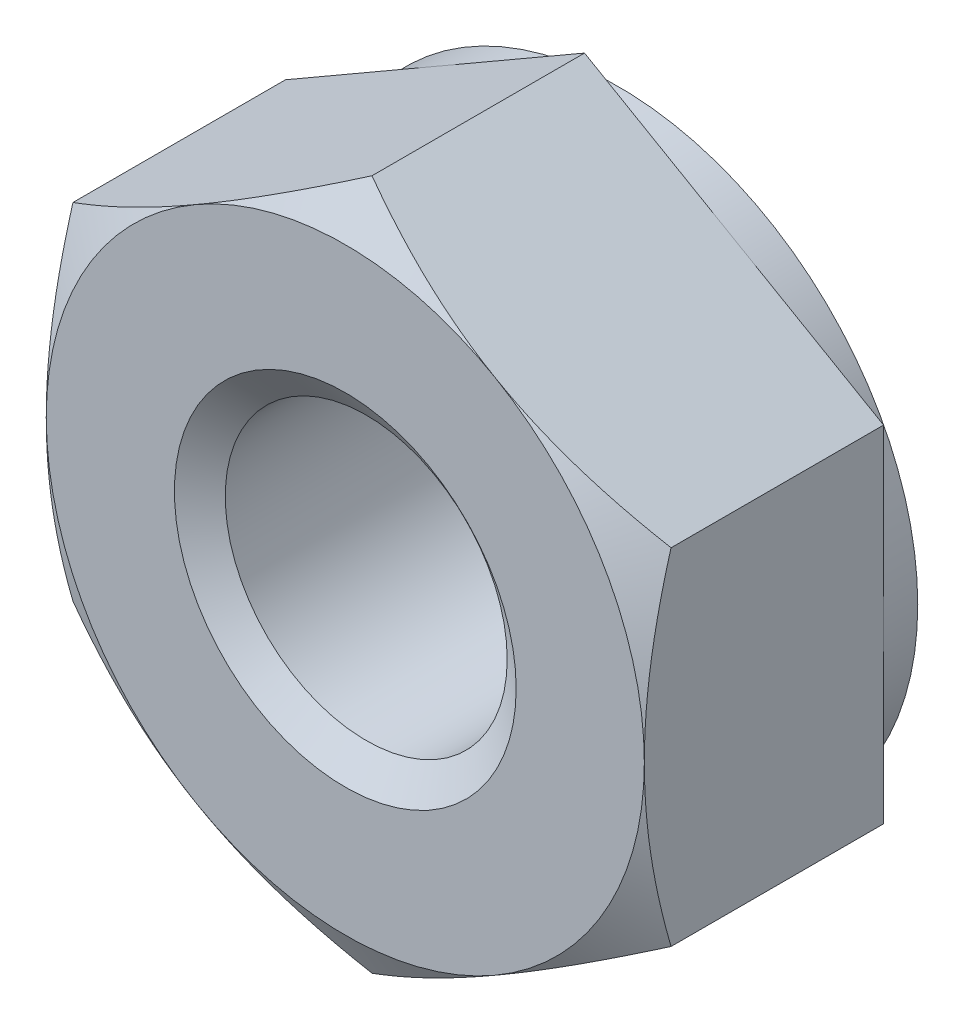
ISO-10303-21;
HEADER;
FILE_DESCRIPTION(('STEP AP214'),'2;1');
FILE_NAME('part.step','',(''),(''),'','','');
FILE_SCHEMA(('AUTOMOTIVE_DESIGN { 1 0 10303 214 1 1 1 1 }'));
ENDSEC;
DATA;
#1=APPLICATION_CONTEXT('core data for automotive mechanical design processes');
#2=APPLICATION_PROTOCOL_DEFINITION('international standard','automotive_design',2000,#1);
#3=PRODUCT_CONTEXT('',#1,'mechanical');
#4=PRODUCT('Part','Part','',(#3));
#5=PRODUCT_RELATED_PRODUCT_CATEGORY('part','',(#4));
#6=PRODUCT_DEFINITION_FORMATION('','',#4);
#7=PRODUCT_DEFINITION_CONTEXT('part definition',#1,'design');
#8=PRODUCT_DEFINITION('design','',#6,#7);
#9=PRODUCT_DEFINITION_SHAPE('','',#8);
#10=(LENGTH_UNIT() NAMED_UNIT(*) SI_UNIT(.MILLI.,.METRE.));
#11=(NAMED_UNIT(*) PLANE_ANGLE_UNIT() SI_UNIT($,.RADIAN.));
#12=(NAMED_UNIT(*) SI_UNIT($,.STERADIAN.) SOLID_ANGLE_UNIT());
#13=UNCERTAINTY_MEASURE_WITH_UNIT(LENGTH_MEASURE(1.E-05),#10,'distance_accuracy_value','');
#14=(GEOMETRIC_REPRESENTATION_CONTEXT(3) GLOBAL_UNCERTAINTY_ASSIGNED_CONTEXT((#13)) GLOBAL_UNIT_ASSIGNED_CONTEXT((#10,
#11,#12)) REPRESENTATION_CONTEXT('',''));
#15=CARTESIAN_POINT('',(0.,0.,0.));
#16=DIRECTION('',(0.,0.,1.));
#17=DIRECTION('',(1.,0.,0.));
#18=AXIS2_PLACEMENT_3D('',#15,#16,#17);
#19=CARTESIAN_POINT('',(0.,0.,-3.2));
#20=DIRECTION('',(0.,0.,1.));
#21=DIRECTION('',(1.,0.,0.));
#22=AXIS2_PLACEMENT_3D('',#19,#20,#21);
#23=CYLINDRICAL_SURFACE('',#22,1.65);
#24=CARTESIAN_POINT('',(0.,0.,-0.245072638373387));
#25=DIRECTION('',(0.,0.,1.));
#26=DIRECTION('',(1.,0.,0.));
#27=AXIS2_PLACEMENT_3D('',#24,#25,#26);
#28=CIRCLE('',#27,1.65);
#29=CARTESIAN_POINT('',(1.65,0.,-0.245072638373387));
#30=VERTEX_POINT('',#29);
#31=EDGE_CURVE('E143',#30,#30,#28,.F.);
#32=ORIENTED_EDGE('',*,*,#31,.F.);
#33=EDGE_LOOP('',(#32));
#34=FACE_BOUND('',#33,.T.);
#35=CARTESIAN_POINT('',(0.,0.,-2.9295273616266));
#36=DIRECTION('',(0.,0.,-1.));
#37=DIRECTION('',(-1.,0.,0.));
#38=AXIS2_PLACEMENT_3D('',#35,#36,#37);
#39=CIRCLE('',#38,1.65);
#40=CARTESIAN_POINT('',(-1.65,0.,-2.9295273616266));
#41=VERTEX_POINT('',#40);
#42=EDGE_CURVE('E31',#41,#41,#39,.F.);
#43=ORIENTED_EDGE('',*,*,#42,.F.);
#44=EDGE_LOOP('',(#43));
#45=FACE_BOUND('',#44,.T.);
#46=ADVANCED_FACE('F26',(#34,#45),#23,.F.);
#47=CARTESIAN_POINT('',(0.,4.04145188432739,-3.2));
#48=DIRECTION('',(0.,0.,-1.));
#49=DIRECTION('',(-1.,0.,0.));
#50=AXIS2_PLACEMENT_3D('',#47,#48,#49);
#51=PLANE('',#50);
#52=CARTESIAN_POINT('',(0.,0.,-3.2));
#53=DIRECTION('',(0.,0.,-1.));
#54=DIRECTION('',(-1.,0.,0.));
#55=AXIS2_PLACEMENT_3D('',#52,#53,#54);
#56=CIRCLE('',#55,3.5);
#57=CARTESIAN_POINT('',(-3.5,0.,-3.2));
#58=VERTEX_POINT('',#57);
#59=EDGE_CURVE('E270',#58,#58,#56,.F.);
#60=ORIENTED_EDGE('',*,*,#59,.F.);
#61=EDGE_LOOP('',(#60));
#62=FACE_BOUND('',#61,.T.);
#63=CARTESIAN_POINT('',(0.,0.,-3.2));
#64=DIRECTION('',(0.,0.,-1.));
#65=DIRECTION('',(-1.,0.,0.));
#66=AXIS2_PLACEMENT_3D('',#63,#64,#65);
#67=CIRCLE('',#66,2.);
#68=CARTESIAN_POINT('',(-2.,0.,-3.2));
#69=VERTEX_POINT('',#68);
#70=EDGE_CURVE('E290',#69,#69,#67,.F.);
#71=ORIENTED_EDGE('',*,*,#70,.T.);
#72=EDGE_LOOP('',(#71));
#73=FACE_BOUND('',#72,.T.);
#74=ADVANCED_FACE('F222',(#62,#73),#51,.T.);
#75=CARTESIAN_POINT('',(0.,4.04145188432739,0.));
#76=DIRECTION('',(0.,0.,-1.));
#77=DIRECTION('',(-1.,0.,0.));
#78=AXIS2_PLACEMENT_3D('',#75,#76,#77);
#79=PLANE('',#78);
#80=CARTESIAN_POINT('',(0.,0.,0.));
#81=DIRECTION('',(0.,0.,-1.));
#82=DIRECTION('',(-1.,0.,0.));
#83=AXIS2_PLACEMENT_3D('',#80,#81,#82);
#84=CIRCLE('',#83,3.5);
#85=CARTESIAN_POINT('',(-1.75000000000001,3.03108891324553,0.));
#86=VERTEX_POINT('',#85);
#87=CARTESIAN_POINT('',(-3.5,0.,0.));
#88=VERTEX_POINT('',#87);
#89=EDGE_CURVE('E38',#86,#88,#84,.F.);
#90=ORIENTED_EDGE('',*,*,#89,.T.);
#91=CARTESIAN_POINT('',(-1.75000000000002,-3.03108891324552,0.));
#92=VERTEX_POINT('',#91);
#93=EDGE_CURVE('E11',#88,#92,#84,.F.);
#94=ORIENTED_EDGE('',*,*,#93,.T.);
#95=CARTESIAN_POINT('',(1.75000000000001,-3.03108891324553,0.));
#96=VERTEX_POINT('',#95);
#97=EDGE_CURVE('E36',#92,#96,#84,.F.);
#98=ORIENTED_EDGE('',*,*,#97,.T.);
#99=CARTESIAN_POINT('',(3.5,0.,0.));
#100=VERTEX_POINT('',#99);
#101=EDGE_CURVE('E122',#96,#100,#84,.F.);
#102=ORIENTED_EDGE('',*,*,#101,.T.);
#103=CARTESIAN_POINT('',(0.,0.,0.));
#104=DIRECTION('',(0.,0.,1.));
#105=DIRECTION('',(1.,0.,0.));
#106=AXIS2_PLACEMENT_3D('',#103,#104,#105);
#107=CIRCLE('',#106,3.5);
#108=CARTESIAN_POINT('',(1.75000000000002,3.03108891324552,0.));
#109=VERTEX_POINT('',#108);
#110=EDGE_CURVE('E134',#100,#109,#107,.T.);
#111=ORIENTED_EDGE('',*,*,#110,.T.);
#112=EDGE_CURVE('E149',#109,#86,#84,.F.);
#113=ORIENTED_EDGE('',*,*,#112,.T.);
#114=EDGE_LOOP('',(#90,#94,#98,#102,#111,#113));
#115=FACE_BOUND('',#114,.T.);
#116=CARTESIAN_POINT('',(0.,0.,0.));
#117=DIRECTION('',(0.,0.,1.));
#118=DIRECTION('',(1.,0.,0.));
#119=AXIS2_PLACEMENT_3D('',#116,#117,#118);
#120=CIRCLE('',#119,2.);
#121=CARTESIAN_POINT('',(2.,0.,0.));
#122=VERTEX_POINT('',#121);
#123=EDGE_CURVE('E289',#122,#122,#120,.T.);
#124=ORIENTED_EDGE('',*,*,#123,.F.);
#125=EDGE_LOOP('',(#124));
#126=FACE_BOUND('',#125,.T.);
#127=ADVANCED_FACE('F146',(#115,#126),#79,.F.);
#128=CARTESIAN_POINT('',(0.,4.04145188432739,-3.2));
#129=DIRECTION('',(-0.500000000000003,0.866025403784437,0.));
#130=DIRECTION('',(-0.866025403784437,-0.500000000000003,0.));
#131=AXIS2_PLACEMENT_3D('',#128,#129,#130);
#132=PLANE('',#131);
#133=DIRECTION('',(0.,0.,1.));
#134=VECTOR('',#133,1.);
#135=CARTESIAN_POINT('',(-3.5,2.02072594216368,-3.2));
#136=LINE('',#135,#134);
#137=CARTESIAN_POINT('',(-3.5,2.02072594216368,-2.8));
#138=VERTEX_POINT('',#137);
#139=CARTESIAN_POINT('',(-3.5,2.02072594216368,-0.312607391169653));
#140=VERTEX_POINT('',#139);
#141=EDGE_CURVE('E279',#138,#140,#136,.T.);
#142=ORIENTED_EDGE('',*,*,#141,.T.);
#143=CARTESIAN_POINT('',(-3.5002,2.02061047210984,-0.31267406069337));
#144=CARTESIAN_POINT('',(-3.34639282154755,2.10941108799266,-0.261385788989982));
#145=CARTESIAN_POINT('',(-3.19125798916558,2.19897822522908,-0.214740953816196));
#146=CARTESIAN_POINT('',(-2.87830199342322,2.37966345361544,-0.133321875533347));
#147=CARTESIAN_POINT('',(-2.72047526921251,2.47078475532382,-0.0985764355845601));
#148=CARTESIAN_POINT('',(-2.40677778961987,2.65189807961073,-0.0444900271828349));
#149=CARTESIAN_POINT('',(-2.25095530083931,2.74186223545399,-0.0247890862603805));
#150=CARTESIAN_POINT('',(-1.93857711279463,2.92221386641055,-0.00127013273725367));
#151=CARTESIAN_POINT('',(-1.78202254896577,3.01260068598001,0.00256735545443516));
#152=CARTESIAN_POINT('',(-1.48949078007901,3.1814939814933,-0.00541530187697786));
#153=CARTESIAN_POINT('',(-1.3534697875421,3.26002573814993,-0.0152754340696077));
#154=CARTESIAN_POINT('',(-1.082313979711,3.41657761679354,-0.0465264668994053));
#155=CARTESIAN_POINT('',(-0.947180102315316,3.49459719728458,-0.0679280432858007));
#156=CARTESIAN_POINT('',(-0.675465207594812,3.65147186489429,-0.121430407880581));
#157=CARTESIAN_POINT('',(-0.538918580721659,3.73030709667644,-0.153757994445092));
#158=CARTESIAN_POINT('',(-0.267861907055492,3.88680174018325,-0.227128933808001));
#159=CARTESIAN_POINT('',(-0.133348387531456,3.9644631568901,-0.268155046569875));
#160=CARTESIAN_POINT('',(0.000200000000009097,4.04156735438123,-0.31267406069338));
#161=B_SPLINE_CURVE_WITH_KNOTS('',3,(#143,#144,#145,#146,#147,#148,#149,#150,#151,#152,#153,
#154,#155,#156,#157,#158,#159,#160),.UNSPECIFIED.,.F.,.F.,(4,2,2,2,2,2,2,2,4),(0.,
0.554793832886254,1.11092123814984,1.65328467083219,2.19498204478403,2.6666513085086,
3.13875761298268,3.62133612600511,4.10296698719189),.UNSPECIFIED.);
#162=EDGE_CURVE('E50',#140,#86,#161,.T.);
#163=ORIENTED_EDGE('',*,*,#162,.T.);
#164=CARTESIAN_POINT('',(0.,4.04145188432739,-0.312607391169653));
#165=VERTEX_POINT('',#164);
#166=EDGE_CURVE('E158',#86,#165,#161,.T.);
#167=ORIENTED_EDGE('',*,*,#166,.T.);
#168=DIRECTION('',(0.,0.,1.));
#169=VECTOR('',#168,1.);
#170=CARTESIAN_POINT('',(0.,4.04145188432739,-3.2));
#171=LINE('',#170,#169);
#172=CARTESIAN_POINT('',(0.,4.04145188432739,-2.8));
#173=VERTEX_POINT('',#172);
#174=EDGE_CURVE('E267',#173,#165,#171,.T.);
#175=ORIENTED_EDGE('',*,*,#174,.F.);
#176=DIRECTION('',(-0.866025403784437,-0.500000000000003,0.));
#177=VECTOR('',#176,1.);
#178=CARTESIAN_POINT('',(0.,4.04145188432739,-2.8));
#179=LINE('',#178,#177);
#180=CARTESIAN_POINT('',(-1.75000000000001,3.03108891324553,-2.8));
#181=VERTEX_POINT('',#180);
#182=EDGE_CURVE('E255',#173,#181,#179,.T.);
#183=ORIENTED_EDGE('',*,*,#182,.T.);
#184=EDGE_CURVE('E251',#181,#138,#179,.T.);
#185=ORIENTED_EDGE('',*,*,#184,.T.);
#186=EDGE_LOOP('',(#142,#163,#167,#175,#183,#185));
#187=FACE_BOUND('',#186,.T.);
#188=ADVANCED_FACE('F28',(#187),#132,.T.);
#189=CARTESIAN_POINT('',(3.5,2.02072594216367,-3.2));
#190=DIRECTION('',(0.500000000000007,0.866025403784435,0.));
#191=DIRECTION('',(-0.866025403784435,0.500000000000007,0.));
#192=AXIS2_PLACEMENT_3D('',#189,#190,#191);
#193=PLANE('',#192);
#194=ORIENTED_EDGE('',*,*,#174,.T.);
#195=CARTESIAN_POINT('',(-0.000199999999990839,4.04156735438123,-0.312674060693381));
#196=CARTESIAN_POINT('',(0.153607178452458,3.95276673849841,-0.261385788989992));
#197=CARTESIAN_POINT('',(0.308742010834433,3.86319960126199,-0.214740953816205));
#198=CARTESIAN_POINT('',(0.62169800657679,3.68251437287563,-0.133321875533355));
#199=CARTESIAN_POINT('',(0.779524730787505,3.59139307116726,-0.0985764355845665));
#200=CARTESIAN_POINT('',(1.09322221038014,3.41027974688034,-0.0444900271828393));
#201=CARTESIAN_POINT('',(1.2490446991607,3.32031559103708,-0.0247890862603838));
#202=CARTESIAN_POINT('',(1.56142288720538,3.13996396008051,-0.00127013273725512));
#203=CARTESIAN_POINT('',(1.71797745103424,3.04957714051106,0.0025673554544345));
#204=CARTESIAN_POINT('',(2.010509219921,2.88068384499777,-0.00541530187697712));
#205=CARTESIAN_POINT('',(2.14653021245791,2.80215208834114,-0.0152754340696062));
#206=CARTESIAN_POINT('',(2.417686020289,2.64560020969752,-0.046526466899402));
#207=CARTESIAN_POINT('',(2.55281989768469,2.56758062920648,-0.0679280432857965));
#208=CARTESIAN_POINT('',(2.82453479240519,2.41070596159677,-0.121430407880575));
#209=CARTESIAN_POINT('',(2.96108141927834,2.33187072981462,-0.153757994445085));
#210=CARTESIAN_POINT('',(3.23213809294451,2.17537608630781,-0.227128933807992));
#211=CARTESIAN_POINT('',(3.36665161246854,2.09771466960097,-0.268155046569864));
#212=CARTESIAN_POINT('',(3.5002,2.02061047210983,-0.312674060693368));
#213=B_SPLINE_CURVE_WITH_KNOTS('',3,(#195,#196,#197,#198,#199,#200,#201,#202,#203,#204,#205,
#206,#207,#208,#209,#210,#211,#212),.UNSPECIFIED.,.F.,.F.,(4,2,2,2,2,2,2,2,4),(0.,
0.554793832886256,1.11092123814984,1.65328467083219,2.19498204478404,2.66665130850861,
3.13875761298268,3.62133612600511,4.10296698719188),.UNSPECIFIED.);
#214=EDGE_CURVE('E155',#165,#109,#213,.T.);
#215=ORIENTED_EDGE('',*,*,#214,.T.);
#216=CARTESIAN_POINT('',(3.5,2.02072594216371,-0.312607391169653));
#217=VERTEX_POINT('',#216);
#218=EDGE_CURVE('E137',#109,#217,#213,.T.);
#219=ORIENTED_EDGE('',*,*,#218,.T.);
#220=DIRECTION('',(0.,0.,1.));
#221=VECTOR('',#220,1.);
#222=CARTESIAN_POINT('',(3.5,2.02072594216367,-3.2));
#223=LINE('',#222,#221);
#224=CARTESIAN_POINT('',(3.5,2.02072594216367,-2.8));
#225=VERTEX_POINT('',#224);
#226=EDGE_CURVE('E154',#225,#217,#223,.T.);
#227=ORIENTED_EDGE('',*,*,#226,.F.);
#228=DIRECTION('',(-0.866025403784435,0.500000000000007,0.));
#229=VECTOR('',#228,1.);
#230=CARTESIAN_POINT('',(3.5,2.02072594216367,-2.8));
#231=LINE('',#230,#229);
#232=CARTESIAN_POINT('',(1.75000000000002,3.03108891324552,-2.8));
#233=VERTEX_POINT('',#232);
#234=EDGE_CURVE('E263',#225,#233,#231,.T.);
#235=ORIENTED_EDGE('',*,*,#234,.T.);
#236=EDGE_CURVE('E259',#233,#173,#231,.T.);
#237=ORIENTED_EDGE('',*,*,#236,.T.);
#238=EDGE_LOOP('',(#194,#215,#219,#227,#235,#237));
#239=FACE_BOUND('',#238,.T.);
#240=ADVANCED_FACE('F235',(#239),#193,.T.);
#241=CARTESIAN_POINT('',(3.5,2.02072594216367,-3.2));
#242=DIRECTION('',(-1.,0.,0.));
#243=DIRECTION('',(0.,0.,1.));
#244=AXIS2_PLACEMENT_3D('',#241,#242,#243);
#245=PLANE('',#244);
#246=CARTESIAN_POINT('',(3.5,-5.35926299121409,-1.67484346858558));
#247=CARTESIAN_POINT('',(3.5,-5.20559319908845,-1.60058173692106));
#248=CARTESIAN_POINT('',(3.5,-5.05156008083379,-1.5270582283315));
#249=CARTESIAN_POINT('',(3.5,-4.74257074180714,-1.38190950344754));
#250=CARTESIAN_POINT('',(3.5,-4.5876143668244,-1.31028461582135));
#251=CARTESIAN_POINT('',(3.5,-4.27574500225546,-1.16897765517626));
#252=CARTESIAN_POINT('',(3.5,-4.11882589028195,-1.09930904568018));
#253=CARTESIAN_POINT('',(3.5,-3.80369792903858,-0.962964262242778));
#254=CARTESIAN_POINT('',(3.5,-3.64548914750598,-0.896287932319535));
#255=CARTESIAN_POINT('',(3.5,-3.32556618401858,-0.765931819095082));
#256=CARTESIAN_POINT('',(3.5,-3.16383281219927,-0.70229887368888));
#257=CARTESIAN_POINT('',(3.5,-2.838458409456,-0.580016702089507));
#258=CARTESIAN_POINT('',(3.5,-2.67481716858829,-0.521368030370705));
#259=CARTESIAN_POINT('',(3.5,-2.34570278472052,-0.410630279877034));
#260=CARTESIAN_POINT('',(3.5,-2.18023438248745,-0.358527255435869));
#261=CARTESIAN_POINT('',(3.5,-1.84694522806372,-0.262572936976453));
#262=CARTESIAN_POINT('',(3.5,-1.67912523787533,-0.218719033467167));
#263=CARTESIAN_POINT('',(3.5,-1.34101828610928,-0.141391945584794));
#264=CARTESIAN_POINT('',(3.5,-1.17073068027696,-0.10792152521198));
#265=CARTESIAN_POINT('',(3.5,-0.828102385138509,-0.0536149564320558));
#266=CARTESIAN_POINT('',(3.5,-0.655761694017326,-0.0327788191952412));
#267=CARTESIAN_POINT('',(3.5,-0.311020490924473,-0.00558408650575998));
#268=CARTESIAN_POINT('',(3.5,-0.138627397207282,0.000866163165908653));
#269=CARTESIAN_POINT('',(3.5,0.206038074906514,-0.0010535580779475));
#270=CARTESIAN_POINT('',(3.5,0.37831047302316,-0.00941968196343273));
#271=CARTESIAN_POINT('',(3.5,0.672490555822307,-0.035768892786892));
#272=CARTESIAN_POINT('',(3.5,0.794722791084071,-0.0503206340384207));
#273=CARTESIAN_POINT('',(3.5,1.03824305430558,-0.0859367340533542));
#274=CARTESIAN_POINT('',(3.5,1.15953093025884,-0.107002119926139));
#275=CARTESIAN_POINT('',(3.5,1.52187914771346,-0.178863187081449));
#276=CARTESIAN_POINT('',(3.5,1.76124104212629,-0.238305275622005));
#277=CARTESIAN_POINT('',(3.5,2.11940971387705,-0.340826814402548));
#278=CARTESIAN_POINT('',(3.5,2.24008344316343,-0.377749699085176));
#279=CARTESIAN_POINT('',(3.5,2.48017139213725,-0.455249007699286));
#280=CARTESIAN_POINT('',(3.5,2.5995864179561,-0.495822911663541));
#281=CARTESIAN_POINT('',(3.5,2.83665760451795,-0.579779986782743));
#282=CARTESIAN_POINT('',(3.5,2.9543198820348,-0.623146060034304));
#283=CARTESIAN_POINT('',(3.5,3.18873153508796,-0.712423559566855));
#284=CARTESIAN_POINT('',(3.5,3.3054805195946,-0.758336014592938));
#285=CARTESIAN_POINT('',(3.5,3.42180736613345,-0.805270380724058));
#286=B_SPLINE_CURVE_WITH_KNOTS('',3,(#246,#247,#248,#249,#250,#251,#252,#253,#254,#255,#256,
#257,#258,#259,#260,#261,#262,#263,#264,#265,#266,#267,#268,#269,#270,#271,#272,#273,#274,#275,
#276,#277,#278,#279,#280,#281,#282,#283,#284,#285),.UNSPECIFIED.,.F.,.F.,(4,2,2,2,2,2,2,2,2,2,2,
2,2,2,2,2,2,2,2,4),(0.,0.512025318465739,1.02413870177436,1.53918270315242,2.05419982499224,
2.57553975872799,3.09693761309354,3.61720506610402,4.13730766217539,4.65754858684366,
5.17778997146963,5.69470725122284,6.21149033452403,6.58059623222333,6.94976036239486,
7.68863804939852,8.06719621660479,8.44549507476761,8.82166461280099,9.1979872473341),.UNSPECIFIED.);
#287=CARTESIAN_POINT('',(3.49999999999999,-2.02072594216373,-0.312607391169653));
#288=VERTEX_POINT('',#287);
#289=EDGE_CURVE('E118',#288,#100,#286,.T.);
#290=ORIENTED_EDGE('',*,*,#289,.F.);
#291=DIRECTION('',(0.,0.,1.));
#292=VECTOR('',#291,1.);
#293=CARTESIAN_POINT('',(3.5,-2.02072594216372,-3.2));
#294=LINE('',#293,#292);
#295=CARTESIAN_POINT('',(3.5,-2.02072594216372,-2.8));
#296=VERTEX_POINT('',#295);
#297=EDGE_CURVE('E272',#296,#288,#294,.T.);
#298=ORIENTED_EDGE('',*,*,#297,.F.);
#299=DIRECTION('',(0.,-1.,0.));
#300=VECTOR('',#299,1.);
#301=CARTESIAN_POINT('',(3.5,2.02072594216367,-2.8));
#302=LINE('',#301,#300);
#303=CARTESIAN_POINT('',(3.5,0.,-2.8));
#304=VERTEX_POINT('',#303);
#305=EDGE_CURVE('E264',#304,#296,#302,.T.);
#306=ORIENTED_EDGE('',*,*,#305,.F.);
#307=EDGE_CURVE('E266',#225,#304,#302,.T.);
#308=ORIENTED_EDGE('',*,*,#307,.F.);
#309=ORIENTED_EDGE('',*,*,#226,.T.);
#310=EDGE_CURVE('E131',#100,#217,#286,.T.);
#311=ORIENTED_EDGE('',*,*,#310,.F.);
#312=EDGE_LOOP('',(#290,#298,#306,#308,#309,#311));
#313=FACE_BOUND('',#312,.T.);
#314=ADVANCED_FACE('F151',(#313),#245,.F.);
#315=CARTESIAN_POINT('',(0.,-4.04145188432744,-3.2));
#316=DIRECTION('',(0.500000000000004,-0.866025403784436,0.));
#317=DIRECTION('',(0.866025403784436,0.500000000000004,0.));
#318=AXIS2_PLACEMENT_3D('',#315,#316,#317);
#319=PLANE('',#318);
#320=ORIENTED_EDGE('',*,*,#297,.T.);
#321=CARTESIAN_POINT('',(3.5002,-2.02061047210988,-0.312674060693384));
#322=CARTESIAN_POINT('',(3.34639282154755,-2.1094110879927,-0.261385788989997));
#323=CARTESIAN_POINT('',(3.19125798916558,-2.19897822522913,-0.214740953816211));
#324=CARTESIAN_POINT('',(2.87830199342322,-2.37966345361549,-0.133321875533363));
#325=CARTESIAN_POINT('',(2.7204752692125,-2.47078475532386,-0.0985764355845769));
#326=CARTESIAN_POINT('',(2.40677778961987,-2.65189807961078,-0.0444900271828534));
#327=CARTESIAN_POINT('',(2.25095530083931,-2.74186223545403,-0.0247890862603999));
#328=CARTESIAN_POINT('',(1.93857711279462,-2.9222138664106,-0.00127013273727479));
#329=CARTESIAN_POINT('',(1.78202254896577,-3.01260068598006,0.00256735545441324));
#330=CARTESIAN_POINT('',(1.48949078007901,-3.18149398149335,-0.00541530187700181));
#331=CARTESIAN_POINT('',(1.35346978754209,-3.26002573814998,-0.0152754340696326));
#332=CARTESIAN_POINT('',(1.082313979711,-3.41657761679359,-0.0465264668994311));
#333=CARTESIAN_POINT('',(0.947180102315313,-3.49459719728463,-0.0679280432858265));
#334=CARTESIAN_POINT('',(0.675465207594813,-3.65147186489434,-0.121430407880607));
#335=CARTESIAN_POINT('',(0.538918580721662,-3.73030709667649,-0.153757994445118));
#336=CARTESIAN_POINT('',(0.267861907055497,-3.8868017401833,-0.227128933808027));
#337=CARTESIAN_POINT('',(0.133348387531462,-3.96446315689014,-0.2681550465699));
#338=CARTESIAN_POINT('',(-0.000200000000001484,-4.04156735438127,-0.312674060693404));
#339=B_SPLINE_CURVE_WITH_KNOTS('',3,(#321,#322,#323,#324,#325,#326,#327,#328,#329,#330,#331,
#332,#333,#334,#335,#336,#337,#338),.UNSPECIFIED.,.F.,.F.,(4,2,2,2,2,2,2,2,4),(0.,
0.554793832886257,1.11092123814984,1.6532846708322,2.19498204478404,2.66665130850861,
3.13875761298269,3.62133612600511,4.10296698719189),.UNSPECIFIED.);
#340=EDGE_CURVE('E125',#288,#96,#339,.T.);
#341=ORIENTED_EDGE('',*,*,#340,.T.);
#342=CARTESIAN_POINT('',(0.,-4.04145188432739,-0.312607391169653));
#343=VERTEX_POINT('',#342);
#344=EDGE_CURVE('E165',#96,#343,#339,.T.);
#345=ORIENTED_EDGE('',*,*,#344,.T.);
#346=DIRECTION('',(0.,0.,1.));
#347=VECTOR('',#346,1.);
#348=CARTESIAN_POINT('',(0.,-4.04145188432744,-3.2));
#349=LINE('',#348,#347);
#350=CARTESIAN_POINT('',(0.,-4.04145188432744,-2.8));
#351=VERTEX_POINT('',#350);
#352=EDGE_CURVE('E274',#351,#343,#349,.T.);
#353=ORIENTED_EDGE('',*,*,#352,.F.);
#354=DIRECTION('',(0.866025403784436,0.500000000000004,0.));
#355=VECTOR('',#354,1.);
#356=CARTESIAN_POINT('',(0.,-4.04145188432744,-2.8));
#357=LINE('',#356,#355);
#358=CARTESIAN_POINT('',(1.75000000000003,-3.03108891324556,-2.8));
#359=VERTEX_POINT('',#358);
#360=EDGE_CURVE('E256',#351,#359,#357,.T.);
#361=ORIENTED_EDGE('',*,*,#360,.T.);
#362=EDGE_CURVE('E260',#359,#296,#357,.T.);
#363=ORIENTED_EDGE('',*,*,#362,.T.);
#364=EDGE_LOOP('',(#320,#341,#345,#353,#361,#363));
#365=FACE_BOUND('',#364,.T.);
#366=ADVANCED_FACE('F208',(#365),#319,.T.);
#367=CARTESIAN_POINT('',(-3.5,-2.02072594216371,-3.2));
#368=DIRECTION('',(-0.500000000000006,-0.866025403784435,0.));
#369=DIRECTION('',(0.866025403784435,-0.500000000000006,0.));
#370=AXIS2_PLACEMENT_3D('',#367,#368,#369);
#371=PLANE('',#370);
#372=ORIENTED_EDGE('',*,*,#352,.T.);
#373=CARTESIAN_POINT('',(0.00019999999999873,-4.04156735438127,-0.312674060693404));
#374=CARTESIAN_POINT('',(-0.153607178452452,-3.95276673849845,-0.261385788990015));
#375=CARTESIAN_POINT('',(-0.308742010834428,-3.86319960126203,-0.214740953816227));
#376=CARTESIAN_POINT('',(-0.621698006576788,-3.68251437287567,-0.133321875533376));
#377=CARTESIAN_POINT('',(-0.779524730787504,-3.59139307116729,-0.0985764355845872));
#378=CARTESIAN_POINT('',(-1.09322221038014,-3.41027974688037,-0.0444900271828594));
#379=CARTESIAN_POINT('',(-1.24904469916071,-3.32031559103712,-0.0247890862604038));
#380=CARTESIAN_POINT('',(-1.56142288720539,-3.13996396008055,-0.00127013273727466));
#381=CARTESIAN_POINT('',(-1.71797745103425,-3.04957714051109,0.00256735545441532));
#382=CARTESIAN_POINT('',(-2.01050921992101,-2.8806838449978,-0.00541530187699605));
#383=CARTESIAN_POINT('',(-2.14653021245792,-2.80215208834117,-0.0152754340696249));
#384=CARTESIAN_POINT('',(-2.41768602028901,-2.64560020969756,-0.0465264668994196));
#385=CARTESIAN_POINT('',(-2.55281989768469,-2.56758062920652,-0.0679280432858133));
#386=CARTESIAN_POINT('',(-2.82453479240519,-2.41070596159681,-0.12143040788059));
#387=CARTESIAN_POINT('',(-2.96108141927834,-2.33187072981466,-0.153757994445099));
#388=CARTESIAN_POINT('',(-3.2321380929445,-2.17537608630785,-0.227128933808004));
#389=CARTESIAN_POINT('',(-3.36665161246854,-2.09771466960101,-0.268155046569876));
#390=CARTESIAN_POINT('',(-3.5002,-2.02061047210987,-0.312674060693379));
#391=B_SPLINE_CURVE_WITH_KNOTS('',3,(#373,#374,#375,#376,#377,#378,#379,#380,#381,#382,#383,
#384,#385,#386,#387,#388,#389,#390),.UNSPECIFIED.,.F.,.F.,(4,2,2,2,2,2,2,2,4),(0.,
0.554793832886262,1.11092123814985,1.65328467083221,2.19498204478406,2.66665130850863,
3.13875761298269,3.62133612600511,4.10296698719189),.UNSPECIFIED.);
#392=EDGE_CURVE('E202',#343,#92,#391,.T.);
#393=ORIENTED_EDGE('',*,*,#392,.T.);
#394=CARTESIAN_POINT('',(-3.5,-2.02072594216372,-0.312607391169653));
#395=VERTEX_POINT('',#394);
#396=EDGE_CURVE('E195',#92,#395,#391,.T.);
#397=ORIENTED_EDGE('',*,*,#396,.T.);
#398=DIRECTION('',(0.,0.,1.));
#399=VECTOR('',#398,1.);
#400=CARTESIAN_POINT('',(-3.5,-2.02072594216371,-3.2));
#401=LINE('',#400,#399);
#402=CARTESIAN_POINT('',(-3.5,-2.02072594216371,-2.8));
#403=VERTEX_POINT('',#402);
#404=EDGE_CURVE('E277',#403,#395,#401,.T.);
#405=ORIENTED_EDGE('',*,*,#404,.F.);
#406=DIRECTION('',(0.866025403784435,-0.500000000000006,0.));
#407=VECTOR('',#406,1.);
#408=CARTESIAN_POINT('',(-3.5,-2.02072594216371,-2.8));
#409=LINE('',#408,#407);
#410=CARTESIAN_POINT('',(-1.75000000000004,-3.03108891324555,-2.8));
#411=VERTEX_POINT('',#410);
#412=EDGE_CURVE('E246',#403,#411,#409,.T.);
#413=ORIENTED_EDGE('',*,*,#412,.T.);
#414=EDGE_CURVE('E252',#411,#351,#409,.T.);
#415=ORIENTED_EDGE('',*,*,#414,.T.);
#416=EDGE_LOOP('',(#372,#393,#397,#405,#413,#415));
#417=FACE_BOUND('',#416,.T.);
#418=ADVANCED_FACE('F204',(#417),#371,.T.);
#419=CARTESIAN_POINT('',(-3.5,2.02072594216368,-3.2));
#420=DIRECTION('',(-1.,0.,0.));
#421=DIRECTION('',(0.,0.,1.));
#422=AXIS2_PLACEMENT_3D('',#419,#420,#421);
#423=PLANE('',#422);
#424=ORIENTED_EDGE('',*,*,#404,.T.);
#425=CARTESIAN_POINT('',(-3.5,-5.35926299121408,-1.67484346858557));
#426=CARTESIAN_POINT('',(-3.5,-5.20559319908844,-1.60058173692105));
#427=CARTESIAN_POINT('',(-3.5,-5.05156008083377,-1.52705822833149));
#428=CARTESIAN_POINT('',(-3.5,-4.74257074180712,-1.38190950344753));
#429=CARTESIAN_POINT('',(-3.5,-4.58761436682439,-1.31028461582134));
#430=CARTESIAN_POINT('',(-3.5,-4.27574500225544,-1.16897765517625));
#431=CARTESIAN_POINT('',(-3.5,-4.11882589028194,-1.09930904568017));
#432=CARTESIAN_POINT('',(-3.5,-3.80369792903857,-0.962964262242771));
#433=CARTESIAN_POINT('',(-3.5,-3.64548914750597,-0.896287932319528));
#434=CARTESIAN_POINT('',(-3.5,-3.32556618401857,-0.765931819095077));
#435=CARTESIAN_POINT('',(-3.5,-3.16383281219925,-0.702298873688874));
#436=CARTESIAN_POINT('',(-3.5,-2.83845840945599,-0.580016702089501));
#437=CARTESIAN_POINT('',(-3.5,-2.67481716858828,-0.521368030370699));
#438=CARTESIAN_POINT('',(-3.5,-2.34570278472051,-0.410630279877028));
#439=CARTESIAN_POINT('',(-3.5,-2.18023438248744,-0.358527255435864));
#440=CARTESIAN_POINT('',(-3.5,-1.84694522806371,-0.262572936976449));
#441=CARTESIAN_POINT('',(-3.5,-1.67912523787532,-0.218719033467163));
#442=CARTESIAN_POINT('',(-3.5,-1.34101828610926,-0.14139194558479));
#443=CARTESIAN_POINT('',(-3.5,-1.17073068027695,-0.107921525211976));
#444=CARTESIAN_POINT('',(-3.5,-0.8281023851385,-0.0536149564320526));
#445=CARTESIAN_POINT('',(-3.5,-0.655761694017317,-0.0327788191952382));
#446=CARTESIAN_POINT('',(-3.5,-0.311020490924464,-0.00558408650575744));
#447=CARTESIAN_POINT('',(-3.5,-0.138627397207274,0.000866163165910966));
#448=CARTESIAN_POINT('',(-3.5,0.206038074906521,-0.0010535580779458));
#449=CARTESIAN_POINT('',(-3.5,0.378310473023166,-0.0094196819634314));
#450=CARTESIAN_POINT('',(-3.5,0.672490555822313,-0.0357688927868908));
#451=CARTESIAN_POINT('',(-3.5,0.794722791084077,-0.0503206340384196));
#452=CARTESIAN_POINT('',(-3.5,1.03824305430558,-0.0859367340533533));
#453=CARTESIAN_POINT('',(-3.5,1.15953093025885,-0.107002119926138));
#454=CARTESIAN_POINT('',(-3.5,1.52187914771346,-0.178863187081449));
#455=CARTESIAN_POINT('',(-3.5,1.7612410421263,-0.238305275622004));
#456=CARTESIAN_POINT('',(-3.5,2.11940971387706,-0.340826814402548));
#457=CARTESIAN_POINT('',(-3.5,2.24008344316344,-0.377749699085176));
#458=CARTESIAN_POINT('',(-3.5,2.48017139213726,-0.455249007699286));
#459=CARTESIAN_POINT('',(-3.5,2.5995864179561,-0.495822911663542));
#460=CARTESIAN_POINT('',(-3.5,2.83665760451796,-0.579779986782743));
#461=CARTESIAN_POINT('',(-3.5,2.95431988203481,-0.623146060034305));
#462=CARTESIAN_POINT('',(-3.5,3.18873153508797,-0.712423559566856));
#463=CARTESIAN_POINT('',(-3.5,3.30548051959461,-0.758336014592939));
#464=CARTESIAN_POINT('',(-3.5,3.42180736613346,-0.805270380724059));
#465=B_SPLINE_CURVE_WITH_KNOTS('',3,(#425,#426,#427,#428,#429,#430,#431,#432,#433,#434,#435,
#436,#437,#438,#439,#440,#441,#442,#443,#444,#445,#446,#447,#448,#449,#450,#451,#452,#453,#454,
#455,#456,#457,#458,#459,#460,#461,#462,#463,#464),.UNSPECIFIED.,.F.,.F.,(4,2,2,2,2,2,2,2,2,2,2,
2,2,2,2,2,2,2,2,4),(0.,0.512025318465739,1.02413870177436,1.53918270315241,2.05419982499224,
2.57553975872799,3.09693761309353,3.61720506610401,4.13730766217538,4.65754858684365,
5.17778997146962,5.69470725122283,6.21149033452402,6.58059623222332,6.94976036239485,
7.68863804939851,8.06719621660478,8.4454950747676,8.82166461280098,9.19798724733409),.UNSPECIFIED.);
#466=EDGE_CURVE('E203',#395,#88,#465,.T.);
#467=ORIENTED_EDGE('',*,*,#466,.T.);
#468=EDGE_CURVE('E142',#88,#140,#465,.T.);
#469=ORIENTED_EDGE('',*,*,#468,.T.);
#470=ORIENTED_EDGE('',*,*,#141,.F.);
#471=DIRECTION('',(0.,-1.,0.));
#472=VECTOR('',#471,1.);
#473=CARTESIAN_POINT('',(-3.5,2.02072594216368,-2.8));
#474=LINE('',#473,#472);
#475=CARTESIAN_POINT('',(-3.5,0.,-2.8));
#476=VERTEX_POINT('',#475);
#477=EDGE_CURVE('E286',#138,#476,#474,.T.);
#478=ORIENTED_EDGE('',*,*,#477,.T.);
#479=EDGE_CURVE('E284',#476,#403,#474,.T.);
#480=ORIENTED_EDGE('',*,*,#479,.T.);
#481=EDGE_LOOP('',(#424,#467,#469,#470,#478,#480));
#482=FACE_BOUND('',#481,.T.);
#483=ADVANCED_FACE('F207',(#482),#423,.T.);
#484=CARTESIAN_POINT('',(0.,14.0414518843274,-2.8));
#485=DIRECTION('',(0.,0.,-1.));
#486=DIRECTION('',(-1.,0.,0.));
#487=AXIS2_PLACEMENT_3D('',#484,#485,#486);
#488=PLANE('',#487);
#489=ORIENTED_EDGE('',*,*,#307,.T.);
#490=CARTESIAN_POINT('',(0.,0.,-2.8));
#491=DIRECTION('',(0.,0.,1.));
#492=DIRECTION('',(1.,0.,0.));
#493=AXIS2_PLACEMENT_3D('',#490,#491,#492);
#494=CIRCLE('',#493,3.5);
#495=EDGE_CURVE('E243',#304,#233,#494,.T.);
#496=ORIENTED_EDGE('',*,*,#495,.T.);
#497=ORIENTED_EDGE('',*,*,#234,.F.);
#498=EDGE_LOOP('',(#489,#496,#497));
#499=FACE_BOUND('',#498,.T.);
#500=ADVANCED_FACE('F213',(#499),#488,.T.);
#501=ORIENTED_EDGE('',*,*,#305,.T.);
#502=ORIENTED_EDGE('',*,*,#362,.F.);
#503=EDGE_CURVE('E248',#359,#304,#494,.T.);
#504=ORIENTED_EDGE('',*,*,#503,.T.);
#505=EDGE_LOOP('',(#501,#502,#504));
#506=FACE_BOUND('',#505,.T.);
#507=ADVANCED_FACE('F218',(#506),#488,.T.);
#508=EDGE_CURVE('E247',#233,#181,#494,.T.);
#509=ORIENTED_EDGE('',*,*,#508,.T.);
#510=ORIENTED_EDGE('',*,*,#182,.F.);
#511=ORIENTED_EDGE('',*,*,#236,.F.);
#512=EDGE_LOOP('',(#509,#510,#511));
#513=FACE_BOUND('',#512,.T.);
#514=ADVANCED_FACE('F394',(#513),#488,.T.);
#515=ORIENTED_EDGE('',*,*,#414,.F.);
#516=EDGE_CURVE('E448',#411,#359,#494,.T.);
#517=ORIENTED_EDGE('',*,*,#516,.T.);
#518=ORIENTED_EDGE('',*,*,#360,.F.);
#519=EDGE_LOOP('',(#515,#517,#518));
#520=FACE_BOUND('',#519,.T.);
#521=ADVANCED_FACE('F387',(#520),#488,.T.);
#522=EDGE_CURVE('E462',#181,#476,#494,.T.);
#523=ORIENTED_EDGE('',*,*,#522,.T.);
#524=ORIENTED_EDGE('',*,*,#477,.F.);
#525=ORIENTED_EDGE('',*,*,#184,.F.);
#526=EDGE_LOOP('',(#523,#524,#525));
#527=FACE_BOUND('',#526,.T.);
#528=ADVANCED_FACE('F375',(#527),#488,.T.);
#529=CARTESIAN_POINT('',(0.,0.,0.));
#530=DIRECTION('',(0.,0.,1.));
#531=DIRECTION('',(1.,0.,0.));
#532=AXIS2_PLACEMENT_3D('',#529,#530,#531);
#533=CYLINDRICAL_SURFACE('',#532,3.5);
#534=ORIENTED_EDGE('',*,*,#59,.T.);
#535=EDGE_LOOP('',(#534));
#536=FACE_BOUND('',#535,.T.);
#537=ORIENTED_EDGE('',*,*,#508,.F.);
#538=ORIENTED_EDGE('',*,*,#495,.F.);
#539=ORIENTED_EDGE('',*,*,#503,.F.);
#540=ORIENTED_EDGE('',*,*,#516,.F.);
#541=EDGE_CURVE('E464',#476,#411,#494,.T.);
#542=ORIENTED_EDGE('',*,*,#541,.F.);
#543=ORIENTED_EDGE('',*,*,#522,.F.);
#544=EDGE_LOOP('',(#537,#538,#539,#540,#542,#543));
#545=FACE_BOUND('',#544,.T.);
#546=ADVANCED_FACE('F233',(#536,#545),#533,.T.);
#547=ORIENTED_EDGE('',*,*,#479,.F.);
#548=ORIENTED_EDGE('',*,*,#541,.T.);
#549=ORIENTED_EDGE('',*,*,#412,.F.);
#550=EDGE_LOOP('',(#547,#548,#549));
#551=FACE_BOUND('',#550,.T.);
#552=ADVANCED_FACE('F185',(#551),#488,.T.);
#553=CARTESIAN_POINT('',(0.,0.,0.));
#554=DIRECTION('',(0.,0.,-1.));
#555=DIRECTION('',(-1.,0.,0.));
#556=AXIS2_PLACEMENT_3D('',#553,#554,#555);
#557=CONICAL_SURFACE('',#556,3.5,1.0471975511966);
#558=ORIENTED_EDGE('',*,*,#468,.F.);
#559=ORIENTED_EDGE('',*,*,#89,.F.);
#560=ORIENTED_EDGE('',*,*,#162,.F.);
#561=EDGE_LOOP('',(#558,#559,#560));
#562=FACE_BOUND('',#561,.T.);
#563=ADVANCED_FACE('F347',(#562),#557,.T.);
#564=ORIENTED_EDGE('',*,*,#112,.F.);
#565=ORIENTED_EDGE('',*,*,#214,.F.);
#566=ORIENTED_EDGE('',*,*,#166,.F.);
#567=EDGE_LOOP('',(#564,#565,#566));
#568=FACE_BOUND('',#567,.T.);
#569=ADVANCED_FACE('F183',(#568),#557,.T.);
#570=ORIENTED_EDGE('',*,*,#110,.F.);
#571=ORIENTED_EDGE('',*,*,#310,.T.);
#572=ORIENTED_EDGE('',*,*,#218,.F.);
#573=EDGE_LOOP('',(#570,#571,#572));
#574=FACE_BOUND('',#573,.T.);
#575=ADVANCED_FACE('F135',(#574),#557,.T.);
#576=ORIENTED_EDGE('',*,*,#289,.T.);
#577=ORIENTED_EDGE('',*,*,#101,.F.);
#578=ORIENTED_EDGE('',*,*,#340,.F.);
#579=EDGE_LOOP('',(#576,#577,#578));
#580=FACE_BOUND('',#579,.T.);
#581=ADVANCED_FACE('F120',(#580),#557,.T.);
#582=ORIENTED_EDGE('',*,*,#97,.F.);
#583=ORIENTED_EDGE('',*,*,#392,.F.);
#584=ORIENTED_EDGE('',*,*,#344,.F.);
#585=EDGE_LOOP('',(#582,#583,#584));
#586=FACE_BOUND('',#585,.T.);
#587=ADVANCED_FACE('F182',(#586),#557,.T.);
#588=ORIENTED_EDGE('',*,*,#93,.F.);
#589=ORIENTED_EDGE('',*,*,#466,.F.);
#590=ORIENTED_EDGE('',*,*,#396,.F.);
#591=EDGE_LOOP('',(#588,#589,#590));
#592=FACE_BOUND('',#591,.T.);
#593=ADVANCED_FACE('F176',(#592),#557,.T.);
#594=CARTESIAN_POINT('',(0.,0.,-0.269579902210725));
#595=DIRECTION('',(0.,0.,1.));
#596=DIRECTION('',(1.,0.,0.));
#597=AXIS2_PLACEMENT_3D('',#594,#595,#596);
#598=CONICAL_SURFACE('',#597,1.615,0.959931088596896);
#599=ORIENTED_EDGE('',*,*,#123,.T.);
#600=EDGE_LOOP('',(#599));
#601=FACE_BOUND('',#600,.T.);
#602=ORIENTED_EDGE('',*,*,#31,.T.);
#603=EDGE_LOOP('',(#602));
#604=FACE_BOUND('',#603,.T.);
#605=ADVANCED_FACE('F181',(#601,#604),#598,.F.);
#606=CARTESIAN_POINT('',(0.,0.,-3.1746));
#607=DIRECTION('',(0.,0.,-1.));
#608=DIRECTION('',(-1.,0.,0.));
#609=AXIS2_PLACEMENT_3D('',#606,#607,#608);
#610=CONICAL_SURFACE('',#609,2.,0.959931088596879);
#611=CARTESIAN_POINT('',(0.,0.,-3.1746));
#612=DIRECTION('',(0.,0.,1.));
#613=DIRECTION('',(1.,0.,0.));
#614=AXIS2_PLACEMENT_3D('',#611,#612,#613);
#615=CIRCLE('',#614,2.);
#616=CARTESIAN_POINT('',(2.,0.,-3.1746));
#617=VERTEX_POINT('',#616);
#618=EDGE_CURVE('E292',#617,#617,#615,.T.);
#619=ORIENTED_EDGE('',*,*,#618,.F.);
#620=EDGE_LOOP('',(#619));
#621=FACE_BOUND('',#620,.T.);
#622=ORIENTED_EDGE('',*,*,#42,.T.);
#623=EDGE_LOOP('',(#622));
#624=FACE_BOUND('',#623,.T.);
#625=ADVANCED_FACE('F306',(#621,#624),#610,.F.);
#626=CARTESIAN_POINT('',(0.,0.,-25.0375057290932));
#627=DIRECTION('',(0.,0.,1.));
#628=DIRECTION('',(1.,0.,0.));
#629=AXIS2_PLACEMENT_3D('',#626,#627,#628);
#630=CYLINDRICAL_SURFACE('',#629,2.);
#631=ORIENTED_EDGE('',*,*,#70,.F.);
#632=EDGE_LOOP('',(#631));
#633=FACE_BOUND('',#632,.T.);
#634=ORIENTED_EDGE('',*,*,#618,.T.);
#635=EDGE_LOOP('',(#634));
#636=FACE_BOUND('',#635,.T.);
#637=ADVANCED_FACE('F310',(#633,#636),#630,.F.);
#638=CLOSED_SHELL('',(#46,#74,#127,#188,#240,#314,#366,#418,#483,#500,#507,#514,#521,#528,#546,
#552,#563,#569,#575,#581,#587,#593,#605,#625,#637));
#639=MANIFOLD_SOLID_BREP('B2',#638);
#640=ADVANCED_BREP_SHAPE_REPRESENTATION('',(#18,#639),#14);
#641=SHAPE_DEFINITION_REPRESENTATION(#9,#640);
ENDSEC;
END-ISO-10303-21;
